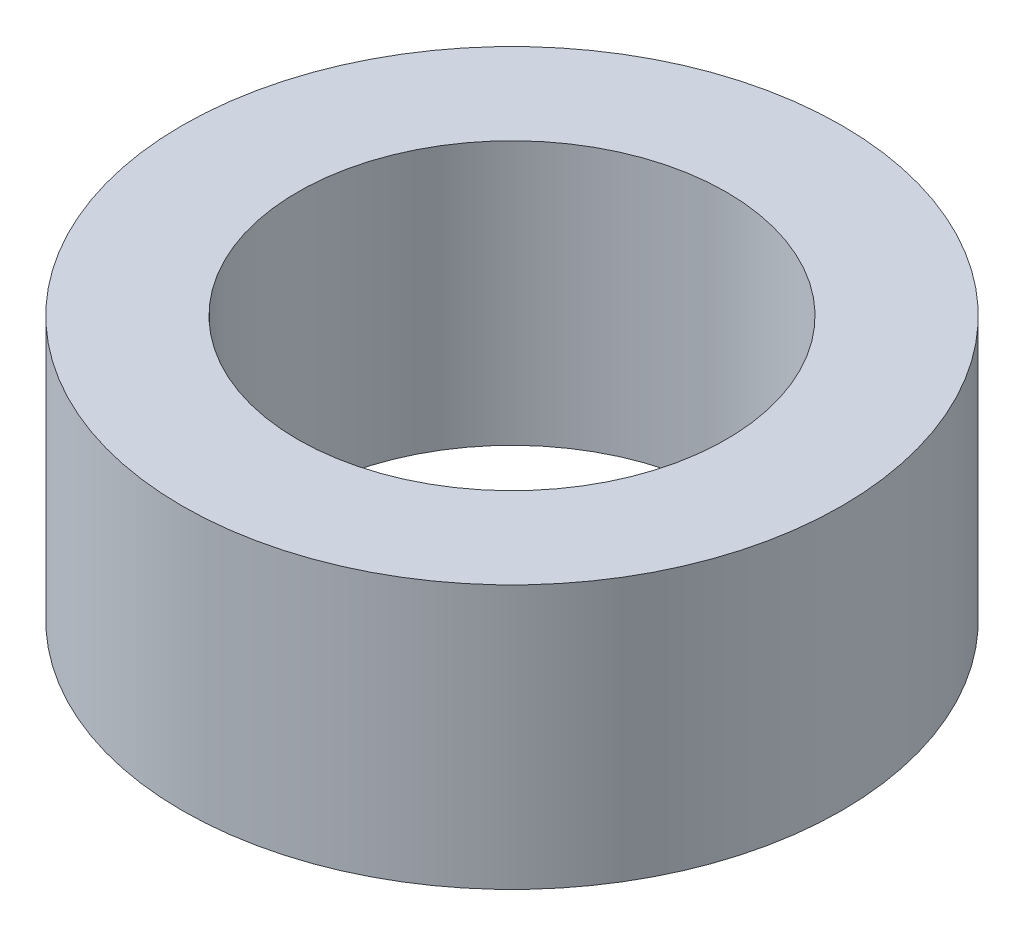
ISO-10303-21;
HEADER;
FILE_DESCRIPTION(('STEP AP214'),'2;1');
FILE_NAME('part.step','',(''),(''),'','','');
FILE_SCHEMA(('AUTOMOTIVE_DESIGN { 1 0 10303 214 1 1 1 1 }'));
ENDSEC;
DATA;
#1=APPLICATION_CONTEXT('core data for automotive mechanical design processes');
#2=APPLICATION_PROTOCOL_DEFINITION('international standard','automotive_design',2000,#1);
#3=PRODUCT_CONTEXT('',#1,'mechanical');
#4=PRODUCT('Part','Part','',(#3));
#5=PRODUCT_RELATED_PRODUCT_CATEGORY('part','',(#4));
#6=PRODUCT_DEFINITION_FORMATION('','',#4);
#7=PRODUCT_DEFINITION_CONTEXT('part definition',#1,'design');
#8=PRODUCT_DEFINITION('design','',#6,#7);
#9=PRODUCT_DEFINITION_SHAPE('','',#8);
#10=(LENGTH_UNIT() NAMED_UNIT(*) SI_UNIT(.MILLI.,.METRE.));
#11=(NAMED_UNIT(*) PLANE_ANGLE_UNIT() SI_UNIT($,.RADIAN.));
#12=(NAMED_UNIT(*) SI_UNIT($,.STERADIAN.) SOLID_ANGLE_UNIT());
#13=UNCERTAINTY_MEASURE_WITH_UNIT(LENGTH_MEASURE(1.E-05),#10,'distance_accuracy_value','');
#14=(GEOMETRIC_REPRESENTATION_CONTEXT(3) GLOBAL_UNCERTAINTY_ASSIGNED_CONTEXT((#13)) GLOBAL_UNIT_ASSIGNED_CONTEXT((#10,
#11,#12)) REPRESENTATION_CONTEXT('',''));
#15=CARTESIAN_POINT('',(0.,0.,0.));
#16=DIRECTION('',(0.,0.,1.));
#17=DIRECTION('',(1.,0.,0.));
#18=AXIS2_PLACEMENT_3D('',#15,#16,#17);
#19=CARTESIAN_POINT('',(0.,6.,0.));
#20=DIRECTION('',(0.,1.,0.));
#21=DIRECTION('',(0.,0.,1.));
#22=AXIS2_PLACEMENT_3D('',#19,#20,#21);
#23=PLANE('',#22);
#24=CARTESIAN_POINT('',(0.,6.,0.));
#25=DIRECTION('',(0.,1.,0.));
#26=DIRECTION('',(0.,0.,1.));
#27=AXIS2_PLACEMENT_3D('',#24,#25,#26);
#28=CIRCLE('',#27,7.5);
#29=CARTESIAN_POINT('',(0.,6.,7.5));
#30=VERTEX_POINT('',#29);
#31=EDGE_CURVE('E10',#30,#30,#28,.T.);
#32=ORIENTED_EDGE('',*,*,#31,.T.);
#33=EDGE_LOOP('',(#32));
#34=FACE_BOUND('',#33,.T.);
#35=CARTESIAN_POINT('',(0.,6.,0.));
#36=DIRECTION('',(0.,1.,0.));
#37=DIRECTION('',(0.,0.,1.));
#38=AXIS2_PLACEMENT_3D('',#35,#36,#37);
#39=CIRCLE('',#38,4.875);
#40=CARTESIAN_POINT('',(0.,6.,4.875));
#41=VERTEX_POINT('',#40);
#42=EDGE_CURVE('E42',#41,#41,#39,.T.);
#43=ORIENTED_EDGE('',*,*,#42,.F.);
#44=EDGE_LOOP('',(#43));
#45=FACE_BOUND('',#44,.T.);
#46=ADVANCED_FACE('F31',(#34,#45),#23,.T.);
#47=CARTESIAN_POINT('',(0.,0.,0.));
#48=DIRECTION('',(0.,1.,0.));
#49=DIRECTION('',(0.,0.,1.));
#50=AXIS2_PLACEMENT_3D('',#47,#48,#49);
#51=PLANE('',#50);
#52=CARTESIAN_POINT('',(0.,0.,0.));
#53=DIRECTION('',(0.,1.,0.));
#54=DIRECTION('',(0.,0.,1.));
#55=AXIS2_PLACEMENT_3D('',#52,#53,#54);
#56=CIRCLE('',#55,7.5);
#57=CARTESIAN_POINT('',(0.,0.,7.5));
#58=VERTEX_POINT('',#57);
#59=EDGE_CURVE('E35',#58,#58,#56,.T.);
#60=ORIENTED_EDGE('',*,*,#59,.F.);
#61=EDGE_LOOP('',(#60));
#62=FACE_BOUND('',#61,.T.);
#63=CARTESIAN_POINT('',(0.,0.,0.));
#64=DIRECTION('',(0.,1.,0.));
#65=DIRECTION('',(0.,0.,1.));
#66=AXIS2_PLACEMENT_3D('',#63,#64,#65);
#67=CIRCLE('',#66,4.875);
#68=CARTESIAN_POINT('',(0.,0.,4.875));
#69=VERTEX_POINT('',#68);
#70=EDGE_CURVE('E44',#69,#69,#67,.T.);
#71=ORIENTED_EDGE('',*,*,#70,.T.);
#72=EDGE_LOOP('',(#71));
#73=FACE_BOUND('',#72,.T.);
#74=ADVANCED_FACE('F54',(#62,#73),#51,.F.);
#75=CARTESIAN_POINT('',(0.,6.,0.));
#76=DIRECTION('',(0.,-1.,0.));
#77=DIRECTION('',(0.,0.,-1.));
#78=AXIS2_PLACEMENT_3D('',#75,#76,#77);
#79=CYLINDRICAL_SURFACE('',#78,7.5);
#80=ORIENTED_EDGE('',*,*,#31,.F.);
#81=EDGE_LOOP('',(#80));
#82=FACE_BOUND('',#81,.T.);
#83=ORIENTED_EDGE('',*,*,#59,.T.);
#84=EDGE_LOOP('',(#83));
#85=FACE_BOUND('',#84,.T.);
#86=ADVANCED_FACE('F33',(#82,#85),#79,.T.);
#87=CARTESIAN_POINT('',(0.,6.,0.));
#88=DIRECTION('',(0.,-1.,0.));
#89=DIRECTION('',(0.,0.,-1.));
#90=AXIS2_PLACEMENT_3D('',#87,#88,#89);
#91=CYLINDRICAL_SURFACE('',#90,4.875);
#92=ORIENTED_EDGE('',*,*,#42,.T.);
#93=EDGE_LOOP('',(#92));
#94=FACE_BOUND('',#93,.T.);
#95=ORIENTED_EDGE('',*,*,#70,.F.);
#96=EDGE_LOOP('',(#95));
#97=FACE_BOUND('',#96,.T.);
#98=ADVANCED_FACE('F50',(#94,#97),#91,.F.);
#99=CLOSED_SHELL('',(#46,#74,#86,#98));
#100=MANIFOLD_SOLID_BREP('B2',#99);
#101=ADVANCED_BREP_SHAPE_REPRESENTATION('',(#18,#100),#14);
#102=SHAPE_DEFINITION_REPRESENTATION(#9,#101);
ENDSEC;
END-ISO-10303-21;
